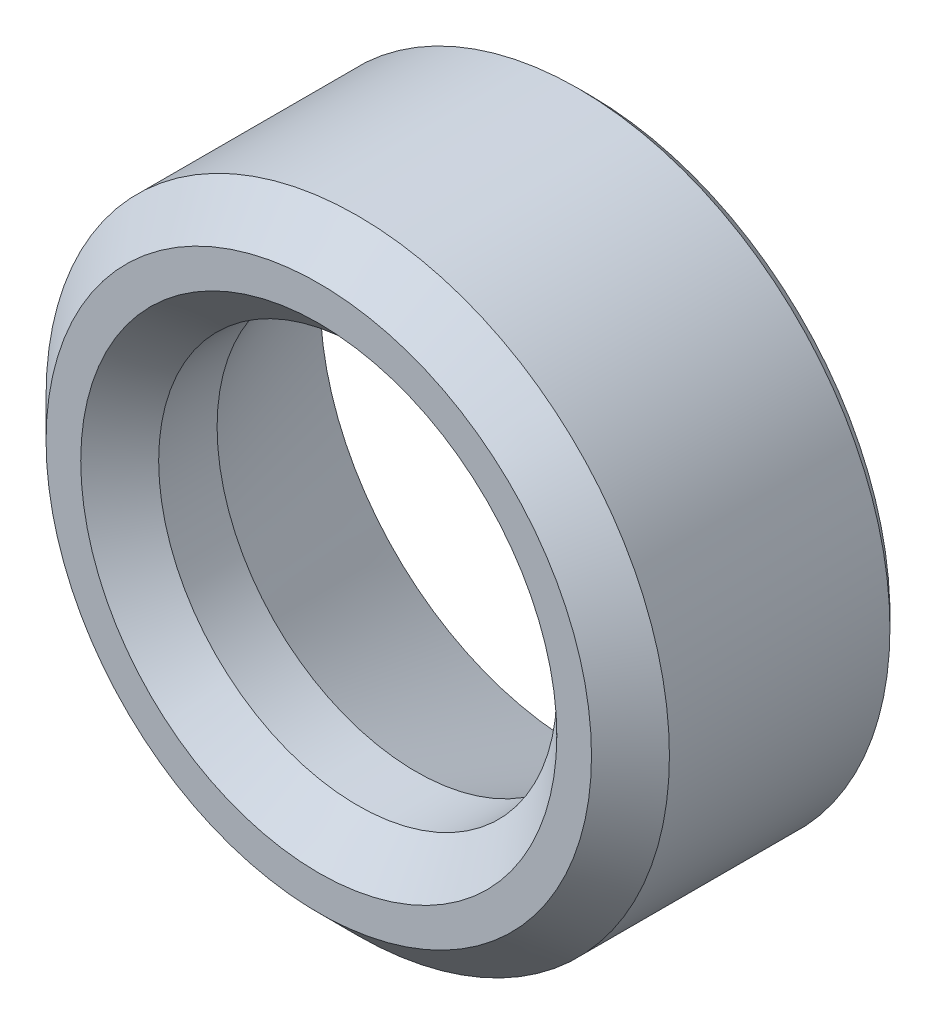
ISO-10303-21;
HEADER;
FILE_DESCRIPTION(('STEP AP214'),'2;1');
FILE_NAME('part.step','',(''),(''),'','','');
FILE_SCHEMA(('AUTOMOTIVE_DESIGN { 1 0 10303 214 1 1 1 1 }'));
ENDSEC;
DATA;
#1=APPLICATION_CONTEXT('core data for automotive mechanical design processes');
#2=APPLICATION_PROTOCOL_DEFINITION('international standard','automotive_design',2000,#1);
#3=PRODUCT_CONTEXT('',#1,'mechanical');
#4=PRODUCT('Part','Part','',(#3));
#5=PRODUCT_RELATED_PRODUCT_CATEGORY('part','',(#4));
#6=PRODUCT_DEFINITION_FORMATION('','',#4);
#7=PRODUCT_DEFINITION_CONTEXT('part definition',#1,'design');
#8=PRODUCT_DEFINITION('design','',#6,#7);
#9=PRODUCT_DEFINITION_SHAPE('','',#8);
#10=(LENGTH_UNIT() NAMED_UNIT(*) SI_UNIT(.MILLI.,.METRE.));
#11=(NAMED_UNIT(*) PLANE_ANGLE_UNIT() SI_UNIT($,.RADIAN.));
#12=(NAMED_UNIT(*) SI_UNIT($,.STERADIAN.) SOLID_ANGLE_UNIT());
#13=UNCERTAINTY_MEASURE_WITH_UNIT(LENGTH_MEASURE(1.E-05),#10,'distance_accuracy_value','');
#14=(GEOMETRIC_REPRESENTATION_CONTEXT(3) GLOBAL_UNCERTAINTY_ASSIGNED_CONTEXT((#13)) GLOBAL_UNIT_ASSIGNED_CONTEXT((#10,
#11,#12)) REPRESENTATION_CONTEXT('',''));
#15=CARTESIAN_POINT('',(0.,0.,0.));
#16=DIRECTION('',(0.,0.,1.));
#17=DIRECTION('',(1.,0.,0.));
#18=AXIS2_PLACEMENT_3D('',#15,#16,#17);
#19=CARTESIAN_POINT('',(0.,0.,0.));
#20=DIRECTION('',(0.,0.,-1.));
#21=DIRECTION('',(1.,0.,0.));
#22=AXIS2_PLACEMENT_3D('',#19,#20,#21);
#23=CYLINDRICAL_SURFACE('',#22,4.);
#24=CARTESIAN_POINT('',(0.,0.,-3.33));
#25=DIRECTION('',(0.,0.,1.));
#26=DIRECTION('',(1.,0.,0.));
#27=AXIS2_PLACEMENT_3D('',#24,#25,#26);
#28=CIRCLE('',#27,4.);
#29=CARTESIAN_POINT('',(-4.,0.,-3.33));
#30=VERTEX_POINT('',#29);
#31=CARTESIAN_POINT('',(0.,4.,-3.33));
#32=VERTEX_POINT('',#31);
#33=EDGE_CURVE('E114',#30,#32,#28,.T.);
#34=ORIENTED_EDGE('',*,*,#33,.T.);
#35=CARTESIAN_POINT('',(0.,0.,-3.33));
#36=DIRECTION('',(0.,0.,1.));
#37=DIRECTION('',(1.,0.,0.));
#38=AXIS2_PLACEMENT_3D('',#35,#36,#37);
#39=CIRCLE('',#38,4.);
#40=EDGE_CURVE('E20',#32,#30,#39,.T.);
#41=ORIENTED_EDGE('',*,*,#40,.T.);
#42=DIRECTION('',(0.,0.,1.));
#43=VECTOR('',#42,1.);
#44=CARTESIAN_POINT('',(-4.,0.,0.));
#45=LINE('',#44,#43);
#46=CARTESIAN_POINT('',(-4.,0.,-0.5));
#47=VERTEX_POINT('',#46);
#48=EDGE_CURVE('E11',#30,#47,#45,.T.);
#49=ORIENTED_EDGE('',*,*,#48,.T.);
#50=CARTESIAN_POINT('',(0.,0.,-0.5));
#51=DIRECTION('',(0.,0.,1.));
#52=DIRECTION('',(1.,0.,0.));
#53=AXIS2_PLACEMENT_3D('',#50,#51,#52);
#54=CIRCLE('',#53,4.);
#55=EDGE_CURVE('E27',#47,#47,#54,.T.);
#56=ORIENTED_EDGE('',*,*,#55,.F.);
#57=ORIENTED_EDGE('',*,*,#48,.F.);
#58=EDGE_LOOP('',(#34,#41,#49,#56,#57));
#59=FACE_BOUND('',#58,.T.);
#60=ADVANCED_FACE('F17',(#59),#23,.T.);
#61=CARTESIAN_POINT('',(0.,0.,-0.25));
#62=DIRECTION('',(0.,0.,-1.));
#63=DIRECTION('',(1.,0.,0.));
#64=AXIS2_PLACEMENT_3D('',#61,#62,#63);
#65=CONICAL_SURFACE('',#64,3.75,0.785398163397448);
#66=CARTESIAN_POINT('',(0.,0.,0.));
#67=DIRECTION('',(0.,0.,-1.));
#68=DIRECTION('',(1.,0.,0.));
#69=AXIS2_PLACEMENT_3D('',#66,#67,#68);
#70=CIRCLE('',#69,3.5);
#71=CARTESIAN_POINT('',(-3.5,0.,0.));
#72=VERTEX_POINT('',#71);
#73=EDGE_CURVE('E76',#72,#72,#70,.T.);
#74=ORIENTED_EDGE('',*,*,#73,.T.);
#75=DIRECTION('',(-0.707106781186547,0.,-0.707106781186548));
#76=VECTOR('',#75,1.);
#77=CARTESIAN_POINT('',(-3.75,0.,-0.25));
#78=LINE('',#77,#76);
#79=EDGE_CURVE('E75',#72,#47,#78,.T.);
#80=ORIENTED_EDGE('',*,*,#79,.T.);
#81=ORIENTED_EDGE('',*,*,#55,.T.);
#82=ORIENTED_EDGE('',*,*,#79,.F.);
#83=EDGE_LOOP('',(#74,#80,#81,#82));
#84=FACE_BOUND('',#83,.T.);
#85=ADVANCED_FACE('F161',(#84),#65,.T.);
#86=CARTESIAN_POINT('',(0.,0.,0.));
#87=DIRECTION('',(0.,0.,-1.));
#88=DIRECTION('',(1.,0.,0.));
#89=AXIS2_PLACEMENT_3D('',#86,#87,#88);
#90=CYLINDRICAL_SURFACE('',#89,2.555);
#91=CARTESIAN_POINT('',(0.,0.,-1.25));
#92=DIRECTION('',(0.,0.,1.));
#93=DIRECTION('',(1.,0.,0.));
#94=AXIS2_PLACEMENT_3D('',#91,#92,#93);
#95=CIRCLE('',#94,2.555);
#96=CARTESIAN_POINT('',(-2.555,0.,-1.25));
#97=VERTEX_POINT('',#96);
#98=CARTESIAN_POINT('',(0.,2.555,-1.25));
#99=VERTEX_POINT('',#98);
#100=EDGE_CURVE('E82',#97,#99,#95,.T.);
#101=ORIENTED_EDGE('',*,*,#100,.F.);
#102=DIRECTION('',(0.,0.,1.));
#103=VECTOR('',#102,1.);
#104=CARTESIAN_POINT('',(-2.555,0.,0.));
#105=LINE('',#104,#103);
#106=CARTESIAN_POINT('',(-2.555,0.,-0.5));
#107=VERTEX_POINT('',#106);
#108=EDGE_CURVE('E65',#97,#107,#105,.T.);
#109=ORIENTED_EDGE('',*,*,#108,.T.);
#110=CARTESIAN_POINT('',(0.,0.,-0.5));
#111=DIRECTION('',(0.,0.,-1.));
#112=DIRECTION('',(1.,0.,0.));
#113=AXIS2_PLACEMENT_3D('',#110,#111,#112);
#114=CIRCLE('',#113,2.555);
#115=EDGE_CURVE('E72',#107,#107,#114,.T.);
#116=ORIENTED_EDGE('',*,*,#115,.F.);
#117=ORIENTED_EDGE('',*,*,#108,.F.);
#118=CARTESIAN_POINT('',(0.,0.,-1.25));
#119=DIRECTION('',(0.,0.,1.));
#120=DIRECTION('',(1.,0.,0.));
#121=AXIS2_PLACEMENT_3D('',#118,#119,#120);
#122=CIRCLE('',#121,2.555);
#123=EDGE_CURVE('E69',#99,#97,#122,.T.);
#124=ORIENTED_EDGE('',*,*,#123,.F.);
#125=EDGE_LOOP('',(#101,#109,#116,#117,#124));
#126=FACE_BOUND('',#125,.T.);
#127=ADVANCED_FACE('F68',(#126),#90,.F.);
#128=CARTESIAN_POINT('',(0.,0.,0.));
#129=DIRECTION('',(0.,0.,1.));
#130=DIRECTION('',(1.,0.,0.));
#131=AXIS2_PLACEMENT_3D('',#128,#129,#130);
#132=PLANE('',#131);
#133=CARTESIAN_POINT('',(0.,0.,0.));
#134=DIRECTION('',(0.,0.,1.));
#135=DIRECTION('',(1.,0.,0.));
#136=AXIS2_PLACEMENT_3D('',#133,#134,#135);
#137=CIRCLE('',#136,3.055);
#138=CARTESIAN_POINT('',(-3.055,0.,0.));
#139=VERTEX_POINT('',#138);
#140=EDGE_CURVE('E129',#139,#139,#137,.T.);
#141=ORIENTED_EDGE('',*,*,#140,.F.);
#142=EDGE_LOOP('',(#141));
#143=FACE_BOUND('',#142,.T.);
#144=ORIENTED_EDGE('',*,*,#73,.F.);
#145=EDGE_LOOP('',(#144));
#146=FACE_BOUND('',#145,.T.);
#147=ADVANCED_FACE('F154',(#143,#146),#132,.T.);
#148=CARTESIAN_POINT('',(0.,0.,-0.25));
#149=DIRECTION('',(0.,0.,1.));
#150=DIRECTION('',(1.,0.,0.));
#151=AXIS2_PLACEMENT_3D('',#148,#149,#150);
#152=CONICAL_SURFACE('',#151,2.805,0.785398163397448);
#153=ORIENTED_EDGE('',*,*,#140,.T.);
#154=DIRECTION('',(0.707106781186547,0.,-0.707106781186548));
#155=VECTOR('',#154,1.);
#156=CARTESIAN_POINT('',(-2.805,0.,-0.25));
#157=LINE('',#156,#155);
#158=EDGE_CURVE('E102',#139,#107,#157,.T.);
#159=ORIENTED_EDGE('',*,*,#158,.T.);
#160=ORIENTED_EDGE('',*,*,#115,.T.);
#161=ORIENTED_EDGE('',*,*,#158,.F.);
#162=EDGE_LOOP('',(#153,#159,#160,#161));
#163=FACE_BOUND('',#162,.T.);
#164=ADVANCED_FACE('F151',(#163),#152,.F.);
#165=CARTESIAN_POINT('',(0.,0.,-3.405));
#166=DIRECTION('',(0.,0.,1.));
#167=DIRECTION('',(0.,-1.,0.));
#168=AXIS2_PLACEMENT_3D('',#165,#166,#167);
#169=CONICAL_SURFACE('',#168,3.925,0.785398163397448);
#170=ORIENTED_EDGE('',*,*,#33,.F.);
#171=ORIENTED_EDGE('',*,*,#40,.F.);
#172=DIRECTION('',(0.,-0.707106781186547,-0.707106781186548));
#173=VECTOR('',#172,1.);
#174=CARTESIAN_POINT('',(0.,3.925,-3.405));
#175=LINE('',#174,#173);
#176=CARTESIAN_POINT('',(0.,3.85,-3.48));
#177=VERTEX_POINT('',#176);
#178=EDGE_CURVE('E126',#32,#177,#175,.T.);
#179=ORIENTED_EDGE('',*,*,#178,.T.);
#180=CARTESIAN_POINT('',(0.,0.,-3.48));
#181=DIRECTION('',(0.,0.,1.));
#182=DIRECTION('',(1.,0.,0.));
#183=AXIS2_PLACEMENT_3D('',#180,#181,#182);
#184=CIRCLE('',#183,3.85);
#185=EDGE_CURVE('E105',#177,#177,#184,.T.);
#186=ORIENTED_EDGE('',*,*,#185,.T.);
#187=ORIENTED_EDGE('',*,*,#178,.F.);
#188=EDGE_LOOP('',(#170,#171,#179,#186,#187));
#189=FACE_BOUND('',#188,.T.);
#190=ADVANCED_FACE('F192',(#189),#169,.T.);
#191=CARTESIAN_POINT('',(0.,0.,-3.405));
#192=DIRECTION('',(0.,0.,-1.));
#193=DIRECTION('',(0.,-1.,0.));
#194=AXIS2_PLACEMENT_3D('',#191,#192,#193);
#195=CONICAL_SURFACE('',#194,3.58102904363685,1.29886313715044);
#196=CARTESIAN_POINT('',(0.,0.,-3.33));
#197=DIRECTION('',(0.,0.,1.));
#198=DIRECTION('',(1.,0.,0.));
#199=AXIS2_PLACEMENT_3D('',#196,#197,#198);
#200=CIRCLE('',#199,3.3120580872737);
#201=CARTESIAN_POINT('',(0.,3.3120580872737,-3.33));
#202=VERTEX_POINT('',#201);
#203=EDGE_CURVE('E87',#202,#202,#200,.T.);
#204=ORIENTED_EDGE('',*,*,#203,.T.);
#205=DIRECTION('',(0.,0.963253453323378,-0.26859408902764));
#206=VECTOR('',#205,1.);
#207=CARTESIAN_POINT('',(0.,3.58102904363685,-3.405));
#208=LINE('',#207,#206);
#209=EDGE_CURVE('E86',#202,#177,#208,.T.);
#210=ORIENTED_EDGE('',*,*,#209,.T.);
#211=ORIENTED_EDGE('',*,*,#185,.F.);
#212=ORIENTED_EDGE('',*,*,#209,.F.);
#213=EDGE_LOOP('',(#204,#210,#211,#212));
#214=FACE_BOUND('',#213,.T.);
#215=ADVANCED_FACE('F138',(#214),#195,.F.);
#216=CARTESIAN_POINT('',(0.,0.,-2.29));
#217=DIRECTION('',(0.,0.,-1.));
#218=DIRECTION('',(0.,-1.,0.));
#219=AXIS2_PLACEMENT_3D('',#216,#217,#218);
#220=CONICAL_SURFACE('',#219,2.93352904363685,0.349065850398866);
#221=ORIENTED_EDGE('',*,*,#100,.T.);
#222=DIRECTION('',(0.,0.342020143325669,-0.939692620785908));
#223=VECTOR('',#222,1.);
#224=CARTESIAN_POINT('',(0.,2.93352904363685,-2.29));
#225=LINE('',#224,#223);
#226=EDGE_CURVE('E84',#99,#202,#225,.T.);
#227=ORIENTED_EDGE('',*,*,#226,.T.);
#228=ORIENTED_EDGE('',*,*,#203,.F.);
#229=ORIENTED_EDGE('',*,*,#226,.F.);
#230=ORIENTED_EDGE('',*,*,#123,.T.);
#231=EDGE_LOOP('',(#221,#227,#228,#229,#230));
#232=FACE_BOUND('',#231,.T.);
#233=ADVANCED_FACE('F80',(#232),#220,.F.);
#234=CLOSED_SHELL('',(#60,#85,#127,#147,#164,#190,#215,#233));
#235=MANIFOLD_SOLID_BREP('B1',#234);
#236=ADVANCED_BREP_SHAPE_REPRESENTATION('',(#18,#235),#14);
#237=SHAPE_DEFINITION_REPRESENTATION(#9,#236);
ENDSEC;
END-ISO-10303-21;
